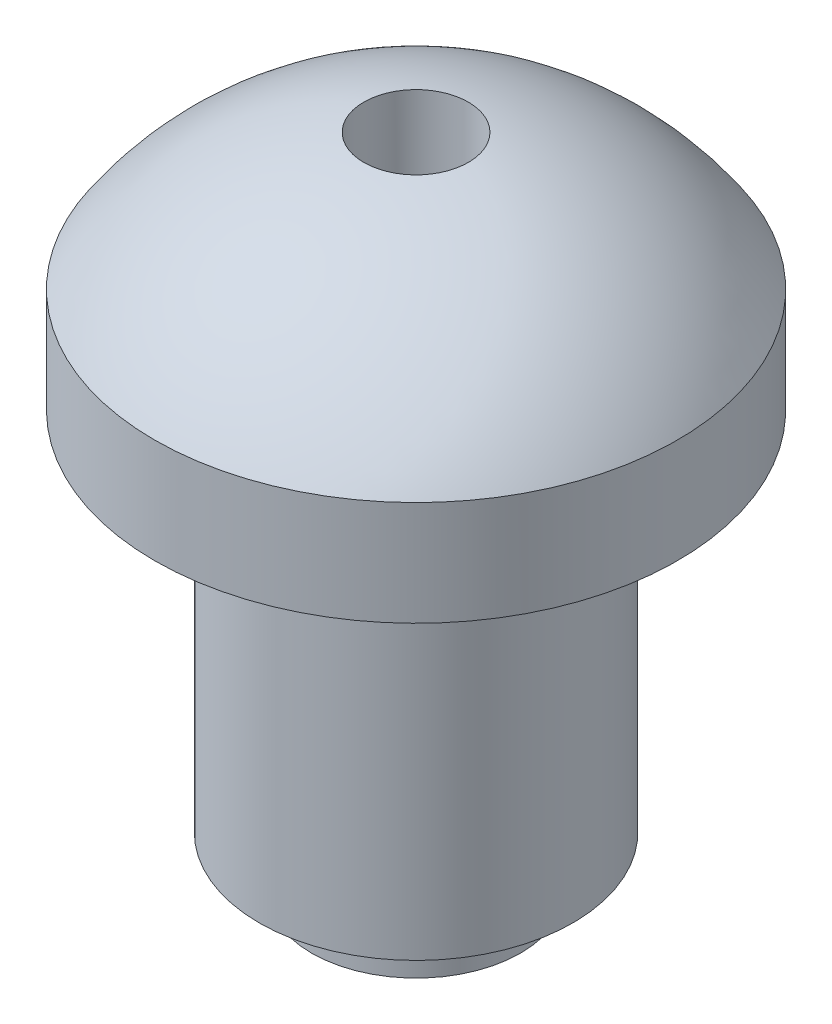
ISO-10303-21;
HEADER;
FILE_DESCRIPTION(('STEP AP214'),'2;1');
FILE_NAME('part.step','',(''),(''),'','','');
FILE_SCHEMA(('AUTOMOTIVE_DESIGN { 1 0 10303 214 1 1 1 1 }'));
ENDSEC;
DATA;
#1=APPLICATION_CONTEXT('core data for automotive mechanical design processes');
#2=APPLICATION_PROTOCOL_DEFINITION('international standard','automotive_design',2000,#1);
#3=PRODUCT_CONTEXT('',#1,'mechanical');
#4=PRODUCT('Part','Part','',(#3));
#5=PRODUCT_RELATED_PRODUCT_CATEGORY('part','',(#4));
#6=PRODUCT_DEFINITION_FORMATION('','',#4);
#7=PRODUCT_DEFINITION_CONTEXT('part definition',#1,'design');
#8=PRODUCT_DEFINITION('design','',#6,#7);
#9=PRODUCT_DEFINITION_SHAPE('','',#8);
#10=(LENGTH_UNIT() NAMED_UNIT(*) SI_UNIT(.MILLI.,.METRE.));
#11=(NAMED_UNIT(*) PLANE_ANGLE_UNIT() SI_UNIT($,.RADIAN.));
#12=(NAMED_UNIT(*) SI_UNIT($,.STERADIAN.) SOLID_ANGLE_UNIT());
#13=UNCERTAINTY_MEASURE_WITH_UNIT(LENGTH_MEASURE(1.E-05),#10,'distance_accuracy_value','');
#14=(GEOMETRIC_REPRESENTATION_CONTEXT(3) GLOBAL_UNCERTAINTY_ASSIGNED_CONTEXT((#13)) GLOBAL_UNIT_ASSIGNED_CONTEXT((#10,
#11,#12)) REPRESENTATION_CONTEXT('',''));
#15=CARTESIAN_POINT('',(0.,0.,0.));
#16=DIRECTION('',(0.,0.,1.));
#17=DIRECTION('',(1.,0.,0.));
#18=AXIS2_PLACEMENT_3D('',#15,#16,#17);
#19=CARTESIAN_POINT('',(0.,9.6833752096446,0.));
#20=DIRECTION('',(0.,-1.,0.));
#21=DIRECTION('',(0.,0.,-1.));
#22=AXIS2_PLACEMENT_3D('',#19,#20,#21);
#23=PLANE('',#22);
#24=CARTESIAN_POINT('',(0.,9.6833752096446,0.));
#25=DIRECTION('',(0.,1.,0.));
#26=DIRECTION('',(0.,0.,1.));
#27=AXIS2_PLACEMENT_3D('',#24,#25,#26);
#28=CIRCLE('',#27,0.999999999999991);
#29=CARTESIAN_POINT('',(0.,9.6833752096446,0.999999999999991));
#30=VERTEX_POINT('',#29);
#31=EDGE_CURVE('E10',#30,#30,#28,.T.);
#32=ORIENTED_EDGE('',*,*,#31,.T.);
#33=EDGE_LOOP('',(#32));
#34=FACE_BOUND('',#33,.T.);
#35=ADVANCED_FACE('F40',(#34),#23,.F.);
#36=CARTESIAN_POINT('',(0.,85.0825571825478,0.));
#37=DIRECTION('',(0.,1.,0.));
#38=DIRECTION('',(0.,0.,1.));
#39=AXIS2_PLACEMENT_3D('',#36,#37,#38);
#40=CYLINDRICAL_SURFACE('',#39,0.999999999999991);
#41=ORIENTED_EDGE('',*,*,#31,.F.);
#42=EDGE_LOOP('',(#41));
#43=FACE_BOUND('',#42,.T.);
#44=CARTESIAN_POINT('',(0.,11.5994549927442,0.));
#45=DIRECTION('',(0.,1.,0.));
#46=DIRECTION('',(0.,0.,1.));
#47=AXIS2_PLACEMENT_3D('',#44,#45,#46);
#48=CIRCLE('',#47,0.999999999999991);
#49=CARTESIAN_POINT('',(-0.999999999999999,11.5994549927442,0.));
#50=VERTEX_POINT('',#49);
#51=EDGE_CURVE('E47',#50,#50,#48,.T.);
#52=ORIENTED_EDGE('',*,*,#51,.T.);
#53=EDGE_LOOP('',(#52));
#54=FACE_BOUND('',#53,.T.);
#55=ADVANCED_FACE('F92',(#43,#54),#40,.F.);
#56=CARTESIAN_POINT('',(0.,5.6833752096446,0.));
#57=DIRECTION('',(0.,1.,0.));
#58=DIRECTION('',(-1.,0.,0.));
#59=AXIS2_PLACEMENT_3D('',#56,#57,#58);
#60=SPHERICAL_SURFACE('',#59,6.);
#61=CARTESIAN_POINT('',(0.,8.99999999999999,0.));
#62=DIRECTION('',(0.,1.,0.));
#63=DIRECTION('',(0.,0.,1.));
#64=AXIS2_PLACEMENT_3D('',#61,#62,#63);
#65=CIRCLE('',#64,4.99999999999999);
#66=CARTESIAN_POINT('',(-5.,8.99999999999999,0.));
#67=VERTEX_POINT('',#66);
#68=EDGE_CURVE('E52',#67,#67,#65,.T.);
#69=CARTESIAN_POINT('',(-5.,8.99999999999999,0.));
#70=CARTESIAN_POINT('',(-4.97175137132336,9.04258668692454,0.));
#71=CARTESIAN_POINT('',(-4.94295841037216,9.08481229653662,0.));
#72=CARTESIAN_POINT('',(-4.88430317248872,9.16851417925746,0.));
#73=CARTESIAN_POINT('',(-4.85444089555649,9.20999045236621,0.));
#74=CARTESIAN_POINT('',(-4.79366637427912,9.29216648020201,0.));
#75=CARTESIAN_POINT('',(-4.76275412993398,9.33286623492906,0.));
#76=CARTESIAN_POINT('',(-4.69989989494913,9.41346268217172,0.));
#77=CARTESIAN_POINT('',(-4.66795790430941,9.45335937468734,0.));
#78=CARTESIAN_POINT('',(-4.60306502001835,9.53232364284611,0.));
#79=CARTESIAN_POINT('',(-4.57011412636702,9.57139121848926,0.));
#80=CARTESIAN_POINT('',(-4.50322495144568,9.64867174895671,0.));
#81=CARTESIAN_POINT('',(-4.46928667017568,9.68688470378101,0.));
#82=CARTESIAN_POINT('',(-4.40044487644419,9.76243104409639,0.));
#83=CARTESIAN_POINT('',(-4.3655413639827,9.79976442958747,0.));
#84=CARTESIAN_POINT('',(-4.29479189542737,9.87352725763964,0.));
#85=CARTESIAN_POINT('',(-4.25894593933354,9.90995670020074,0.));
#86=CARTESIAN_POINT('',(-4.18633498610475,9.98188785876974,0.));
#87=CARTESIAN_POINT('',(-4.14956998896979,10.0173895747776,0.));
#88=CARTESIAN_POINT('',(-4.07514495633088,10.0874421023477,0.));
#89=CARTESIAN_POINT('',(-4.03748492082693,10.1219929139099,0.));
#90=CARTESIAN_POINT('',(-3.96129439844472,10.1901210754972,0.));
#91=CARTESIAN_POINT('',(-3.92276391156646,10.2236984255223,0.));
#92=CARTESIAN_POINT('',(-3.84485764172436,10.2898577424888,0.));
#93=CARTESIAN_POINT('',(-3.80548185876052,10.3224397094301,0.));
#94=CARTESIAN_POINT('',(-3.72591070390069,10.386586988534,0.));
#95=CARTESIAN_POINT('',(-3.68571533200469,10.4181523006966,0.));
#96=CARTESIAN_POINT('',(-3.60453124151697,10.4802456622891,0.));
#97=CARTESIAN_POINT('',(-3.56354252292524,10.5107737117189,0.));
#98=CARTESIAN_POINT('',(-3.48079849923237,10.5707726170862,0.));
#99=CARTESIAN_POINT('',(-3.43904319413121,10.6002434730238,0.));
#100=CARTESIAN_POINT('',(-3.35479325808493,10.658108750854,0.));
#101=CARTESIAN_POINT('',(-3.3122986271398,10.6865031727466,0.));
#102=CARTESIAN_POINT('',(-3.22659778275253,10.7421970447028,0.));
#103=CARTESIAN_POINT('',(-3.18339156931039,10.7694964947664,0.));
#104=CARTESIAN_POINT('',(-3.09629576784487,10.8229826001513,0.));
#105=CARTESIAN_POINT('',(-3.0524061798215,10.8491692554727,0.));
#106=CARTESIAN_POINT('',(-2.9639722832621,10.9004126749672,0.));
#107=CARTESIAN_POINT('',(-2.91942797472607,10.9254694391403,0.));
#108=CARTESIAN_POINT('',(-2.82971371865541,10.9744367176011,0.));
#109=CARTESIAN_POINT('',(-2.78454377112078,10.9983472318888,0.));
#110=CARTESIAN_POINT('',(-2.69360772702609,11.0450064001901,0.));
#111=CARTESIAN_POINT('',(-2.64784163046603,11.0677550542038,0.));
#112=CARTESIAN_POINT('',(-2.55574316749983,11.1120756501095,0.));
#113=CARTESIAN_POINT('',(-2.50941080109369,11.1336475920016,0.));
#114=CARTESIAN_POINT('',(-2.41621004731331,11.1756006800513,0.));
#115=CARTESIAN_POINT('',(-2.36934165993907,11.195981826209,0.));
#116=CARTESIAN_POINT('',(-2.27509946305211,11.2355400166148,0.));
#117=CARTESIAN_POINT('',(-2.22772565353939,11.2547170608628,0.));
#118=CARTESIAN_POINT('',(-2.13250354117425,11.2918545273703,0.));
#119=CARTESIAN_POINT('',(-2.08465523832181,11.3098149496297,0.));
#120=CARTESIAN_POINT('',(-1.98851537787331,11.3445074464562,0.));
#121=CARTESIAN_POINT('',(-1.94022382027723,11.3612395210233,0.));
#122=CARTESIAN_POINT('',(-1.84322897826345,11.3934643983999,0.));
#123=CARTESIAN_POINT('',(-1.79452569384574,11.4089572012094,0.));
#124=CARTESIAN_POINT('',(-1.69673919513943,11.4386934212407,0.));
#125=CARTESIAN_POINT('',(-1.64765598085083,11.4529368384625,0.));
#126=CARTESIAN_POINT('',(-1.54914166655436,11.4801649848584,0.));
#127=CARTESIAN_POINT('',(-1.49971056654648,11.4931497140325,0.));
#128=CARTESIAN_POINT('',(-1.40053275523176,11.5178520197243,0.));
#129=CARTESIAN_POINT('',(-1.35078604392492,11.529569596242,0.));
#130=CARTESIAN_POINT('',(-1.25100947874548,11.5517298992264,0.));
#131=CARTESIAN_POINT('',(-1.2009796248729,11.562172625693,0.));
#132=CARTESIAN_POINT('',(-1.10066947196137,11.5817765876661,0.));
#133=CARTESIAN_POINT('',(-1.05038917292243,11.5909378231725,0.));
#134=CARTESIAN_POINT('',(-0.999999999999999,11.5994549927442,0.));
#135=B_SPLINE_CURVE_WITH_KNOTS('',3,(#69,#70,#71,#72,#73,#74,#75,#76,#77,#78,#79,#80,#81,#82,
#83,#84,#85,#86,#87,#88,#89,#90,#91,#92,#93,#94,#95,#96,#97,#98,#99,#100,#101,#102,#103,#104,
#105,#106,#107,#108,#109,#110,#111,#112,#113,#114,#115,#116,#117,#118,#119,#120,#121,#122,#123,
#124,#125,#126,#127,#128,#129,#130,#131,#132,#133,#134),.UNSPECIFIED.,.F.,.F.,(4,2,2,2,2,2,2,2,
2,2,2,2,2,2,2,2,2,2,2,2,2,2,2,2,2,2,2,2,2,2,2,2,4),(0.,0.153307586320755,0.306615172641511,
0.459922758962266,0.613230345283021,0.766537931603776,0.91984551792453,1.07315310424529,
1.22646069056604,1.37976827688679,1.53307586320755,1.6863834495283,1.83969103584906,
1.99299862216981,2.14630620849057,2.29961379481133,2.45292138113208,2.60622896745284,
2.75953655377359,2.91284414009435,3.0661517264151,3.21945931273586,3.37276689905661,
3.52607448537737,3.67938207169812,3.83268965801888,3.98599724433963,4.13930483066039,
4.29261241698114,4.44592000330189,4.59922758962265,4.75253517594341,4.90584276226416),.UNSPECIFIED.);
#136=EDGE_CURVE('BSEAM96',#67,#50,#135,.T.);
#137=ORIENTED_EDGE('',*,*,#68,.T.);
#138=ORIENTED_EDGE('',*,*,#51,.F.);
#139=ORIENTED_EDGE('',*,*,#136,.T.);
#140=ORIENTED_EDGE('',*,*,#136,.F.);
#141=EDGE_LOOP('',(#137,#139,#138,#140));
#142=FACE_BOUND('',#141,.T.);
#143=ADVANCED_FACE('F96',(#142),#60,.T.);
#144=CARTESIAN_POINT('',(0.,85.0825571825478,0.));
#145=DIRECTION('',(0.,1.,0.));
#146=DIRECTION('',(0.,0.,1.));
#147=AXIS2_PLACEMENT_3D('',#144,#145,#146);
#148=CYLINDRICAL_SURFACE('',#147,4.99999999999999);
#149=ORIENTED_EDGE('',*,*,#68,.F.);
#150=EDGE_LOOP('',(#149));
#151=FACE_BOUND('',#150,.T.);
#152=CARTESIAN_POINT('',(0.,7.00000000000001,0.));
#153=DIRECTION('',(0.,1.,0.));
#154=DIRECTION('',(0.,0.,1.));
#155=AXIS2_PLACEMENT_3D('',#152,#153,#154);
#156=CIRCLE('',#155,4.99999999999999);
#157=CARTESIAN_POINT('',(0.,7.00000000000001,4.99999999999999));
#158=VERTEX_POINT('',#157);
#159=EDGE_CURVE('E57',#158,#158,#156,.T.);
#160=ORIENTED_EDGE('',*,*,#159,.T.);
#161=EDGE_LOOP('',(#160));
#162=FACE_BOUND('',#161,.T.);
#163=ADVANCED_FACE('F101',(#151,#162),#148,.T.);
#164=CARTESIAN_POINT('',(0.,7.,0.));
#165=DIRECTION('',(0.,1.,0.));
#166=DIRECTION('',(0.,0.,1.));
#167=AXIS2_PLACEMENT_3D('',#164,#165,#166);
#168=PLANE('',#167);
#169=ORIENTED_EDGE('',*,*,#159,.F.);
#170=EDGE_LOOP('',(#169));
#171=FACE_BOUND('',#170,.T.);
#172=CARTESIAN_POINT('',(0.,7.00000000000001,0.));
#173=DIRECTION('',(0.,1.,0.));
#174=DIRECTION('',(0.,0.,1.));
#175=AXIS2_PLACEMENT_3D('',#172,#173,#174);
#176=CIRCLE('',#175,3.);
#177=CARTESIAN_POINT('',(0.,7.00000000000001,3.));
#178=VERTEX_POINT('',#177);
#179=EDGE_CURVE('E63',#178,#178,#176,.T.);
#180=ORIENTED_EDGE('',*,*,#179,.T.);
#181=EDGE_LOOP('',(#180));
#182=FACE_BOUND('',#181,.T.);
#183=ADVANCED_FACE('F107',(#171,#182),#168,.F.);
#184=CARTESIAN_POINT('',(0.,85.0825571825478,0.));
#185=DIRECTION('',(0.,1.,0.));
#186=DIRECTION('',(0.,0.,1.));
#187=AXIS2_PLACEMENT_3D('',#184,#185,#186);
#188=CYLINDRICAL_SURFACE('',#187,3.);
#189=ORIENTED_EDGE('',*,*,#179,.F.);
#190=EDGE_LOOP('',(#189));
#191=FACE_BOUND('',#190,.T.);
#192=CARTESIAN_POINT('',(0.,0.,0.));
#193=DIRECTION('',(0.,1.,0.));
#194=DIRECTION('',(0.,0.,1.));
#195=AXIS2_PLACEMENT_3D('',#192,#193,#194);
#196=CIRCLE('',#195,3.);
#197=CARTESIAN_POINT('',(0.,0.,3.));
#198=VERTEX_POINT('',#197);
#199=EDGE_CURVE('E67',#198,#198,#196,.T.);
#200=ORIENTED_EDGE('',*,*,#199,.T.);
#201=EDGE_LOOP('',(#200));
#202=FACE_BOUND('',#201,.T.);
#203=ADVANCED_FACE('F111',(#191,#202),#188,.T.);
#204=CARTESIAN_POINT('',(0.,0.,0.));
#205=DIRECTION('',(0.,1.,0.));
#206=DIRECTION('',(0.,0.,1.));
#207=AXIS2_PLACEMENT_3D('',#204,#205,#206);
#208=PLANE('',#207);
#209=ORIENTED_EDGE('',*,*,#199,.F.);
#210=EDGE_LOOP('',(#209));
#211=FACE_BOUND('',#210,.T.);
#212=CARTESIAN_POINT('',(0.,0.,0.));
#213=DIRECTION('',(0.,1.,0.));
#214=DIRECTION('',(0.,0.,1.));
#215=AXIS2_PLACEMENT_3D('',#212,#213,#214);
#216=CIRCLE('',#215,1.99999999999999);
#217=CARTESIAN_POINT('',(0.,0.,1.99999999999999));
#218=VERTEX_POINT('',#217);
#219=EDGE_CURVE('E71',#218,#218,#216,.T.);
#220=ORIENTED_EDGE('',*,*,#219,.T.);
#221=EDGE_LOOP('',(#220));
#222=FACE_BOUND('',#221,.T.);
#223=ADVANCED_FACE('F89',(#211,#222),#208,.F.);
#224=CARTESIAN_POINT('',(0.,85.0825571825478,0.));
#225=DIRECTION('',(0.,1.,0.));
#226=DIRECTION('',(0.,0.,1.));
#227=AXIS2_PLACEMENT_3D('',#224,#225,#226);
#228=CYLINDRICAL_SURFACE('',#227,1.99999999999999);
#229=CARTESIAN_POINT('',(0.,-1.,0.));
#230=DIRECTION('',(0.,1.,0.));
#231=DIRECTION('',(0.,0.,1.));
#232=AXIS2_PLACEMENT_3D('',#229,#230,#231);
#233=CIRCLE('',#232,1.99999999999999);
#234=CARTESIAN_POINT('',(0.,-1.,1.99999999999999));
#235=VERTEX_POINT('',#234);
#236=EDGE_CURVE('E75',#235,#235,#233,.T.);
#237=ORIENTED_EDGE('',*,*,#236,.T.);
#238=EDGE_LOOP('',(#237));
#239=FACE_BOUND('',#238,.T.);
#240=ORIENTED_EDGE('',*,*,#219,.F.);
#241=EDGE_LOOP('',(#240));
#242=FACE_BOUND('',#241,.T.);
#243=ADVANCED_FACE('F80',(#239,#242),#228,.T.);
#244=CARTESIAN_POINT('',(0.,-1.,0.));
#245=DIRECTION('',(0.,-1.,0.));
#246=DIRECTION('',(0.,0.,-1.));
#247=AXIS2_PLACEMENT_3D('',#244,#245,#246);
#248=PLANE('',#247);
#249=ORIENTED_EDGE('',*,*,#236,.F.);
#250=EDGE_LOOP('',(#249));
#251=FACE_BOUND('',#250,.T.);
#252=ADVANCED_FACE('F83',(#251),#248,.T.);
#253=CLOSED_SHELL('',(#35,#55,#143,#163,#183,#203,#223,#243,#252));
#254=MANIFOLD_SOLID_BREP('B2',#253);
#255=ADVANCED_BREP_SHAPE_REPRESENTATION('',(#18,#254),#14);
#256=SHAPE_DEFINITION_REPRESENTATION(#9,#255);
ENDSEC;
END-ISO-10303-21;
